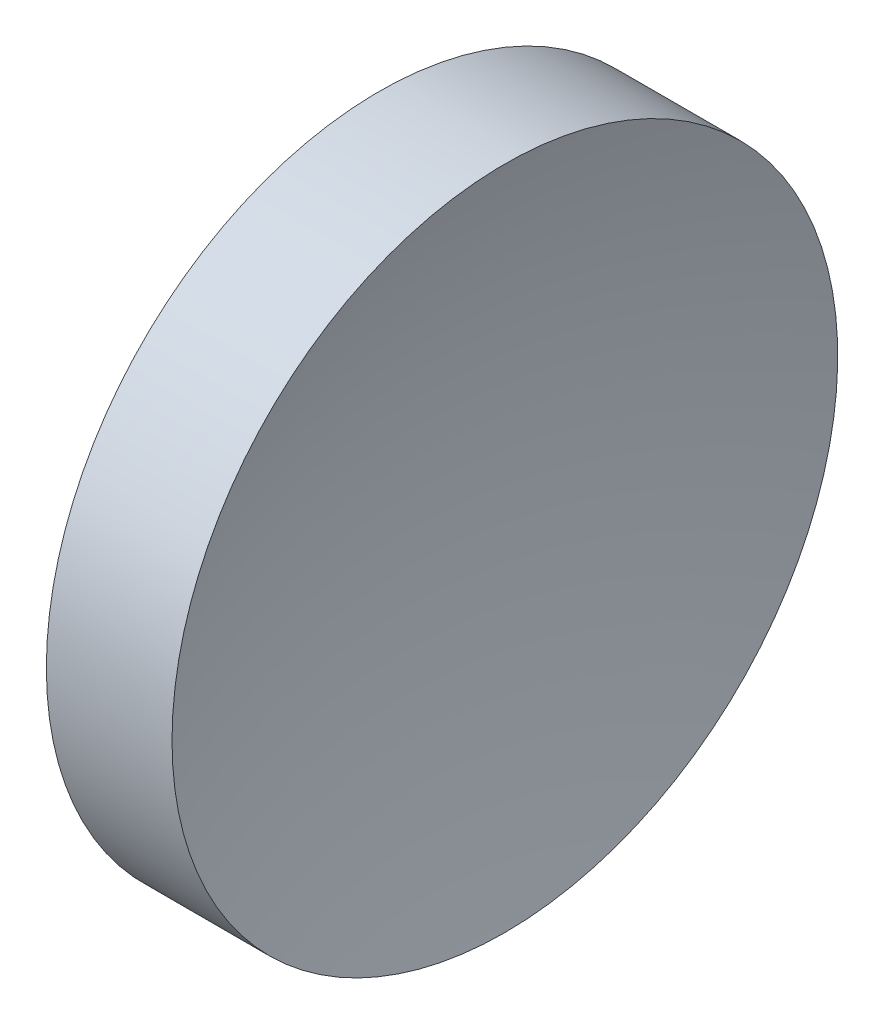
ISO-10303-21;
HEADER;
FILE_DESCRIPTION(('STEP AP214'),'2;1');
FILE_NAME('part.step','',(''),(''),'','','');
FILE_SCHEMA(('AUTOMOTIVE_DESIGN { 1 0 10303 214 1 1 1 1 }'));
ENDSEC;
DATA;
#1=APPLICATION_CONTEXT('core data for automotive mechanical design processes');
#2=APPLICATION_PROTOCOL_DEFINITION('international standard','automotive_design',2000,#1);
#3=PRODUCT_CONTEXT('',#1,'mechanical');
#4=PRODUCT('Part','Part','',(#3));
#5=PRODUCT_RELATED_PRODUCT_CATEGORY('part','',(#4));
#6=PRODUCT_DEFINITION_FORMATION('','',#4);
#7=PRODUCT_DEFINITION_CONTEXT('part definition',#1,'design');
#8=PRODUCT_DEFINITION('design','',#6,#7);
#9=PRODUCT_DEFINITION_SHAPE('','',#8);
#10=(LENGTH_UNIT() NAMED_UNIT(*) SI_UNIT(.MILLI.,.METRE.));
#11=(NAMED_UNIT(*) PLANE_ANGLE_UNIT() SI_UNIT($,.RADIAN.));
#12=(NAMED_UNIT(*) SI_UNIT($,.STERADIAN.) SOLID_ANGLE_UNIT());
#13=UNCERTAINTY_MEASURE_WITH_UNIT(LENGTH_MEASURE(1.E-05),#10,'distance_accuracy_value','');
#14=(GEOMETRIC_REPRESENTATION_CONTEXT(3) GLOBAL_UNCERTAINTY_ASSIGNED_CONTEXT((#13)) GLOBAL_UNIT_ASSIGNED_CONTEXT((#10,
#11,#12)) REPRESENTATION_CONTEXT('',''));
#15=CARTESIAN_POINT('',(0.,0.,0.));
#16=DIRECTION('',(0.,0.,1.));
#17=DIRECTION('',(1.,0.,0.));
#18=AXIS2_PLACEMENT_3D('',#15,#16,#17);
#19=CARTESIAN_POINT('',(72.1737085014825,28.4775956346375,0.));
#20=DIRECTION('',(-1.,0.,0.));
#21=DIRECTION('',(0.,-1.,0.));
#22=AXIS2_PLACEMENT_3D('',#19,#20,#21);
#23=SPHERICAL_SURFACE('',#22,22.92);
#24=CARTESIAN_POINT('',(50.1509044111764,28.4775956346375,0.));
#25=DIRECTION('',(-1.,0.,0.));
#26=DIRECTION('',(0.,0.,1.));
#27=AXIS2_PLACEMENT_3D('',#24,#25,#26);
#28=CIRCLE('',#27,6.35000000000001);
#29=CARTESIAN_POINT('',(50.1509044111764,28.4775956346375,6.35000000000001));
#30=VERTEX_POINT('',#29);
#31=EDGE_CURVE('E10',#30,#30,#28,.T.);
#32=ORIENTED_EDGE('',*,*,#31,.F.);
#33=EDGE_LOOP('',(#32));
#34=FACE_BOUND('',#33,.T.);
#35=ADVANCED_FACE('F35',(#34),#23,.F.);
#36=CARTESIAN_POINT('',(44.7820919030242,28.4775956346375,0.));
#37=DIRECTION('',(-1.,0.,0.));
#38=DIRECTION('',(0.,0.,1.));
#39=AXIS2_PLACEMENT_3D('',#36,#37,#38);
#40=CYLINDRICAL_SURFACE('',#39,6.35);
#41=CARTESIAN_POINT('',(47.7537085014825,28.4775956346375,0.));
#42=DIRECTION('',(-1.,0.,0.));
#43=DIRECTION('',(0.,0.,1.));
#44=AXIS2_PLACEMENT_3D('',#41,#42,#43);
#45=CIRCLE('',#44,6.35);
#46=CARTESIAN_POINT('',(47.7537085014825,28.4775956346375,6.35));
#47=VERTEX_POINT('',#46);
#48=EDGE_CURVE('E41',#47,#47,#45,.T.);
#49=ORIENTED_EDGE('',*,*,#48,.F.);
#50=EDGE_LOOP('',(#49));
#51=FACE_BOUND('',#50,.T.);
#52=ORIENTED_EDGE('',*,*,#31,.T.);
#53=EDGE_LOOP('',(#52));
#54=FACE_BOUND('',#53,.T.);
#55=ADVANCED_FACE('F49',(#51,#54),#40,.T.);
#56=CARTESIAN_POINT('',(47.7537085014825,28.4775956346375,0.));
#57=DIRECTION('',(1.,0.,0.));
#58=DIRECTION('',(0.,0.,-1.));
#59=AXIS2_PLACEMENT_3D('',#56,#57,#58);
#60=PLANE('',#59);
#61=ORIENTED_EDGE('',*,*,#48,.T.);
#62=EDGE_LOOP('',(#61));
#63=FACE_BOUND('',#62,.T.);
#64=ADVANCED_FACE('F47',(#63),#60,.F.);
#65=CLOSED_SHELL('',(#35,#55,#64));
#66=MANIFOLD_SOLID_BREP('B2',#65);
#67=ADVANCED_BREP_SHAPE_REPRESENTATION('',(#18,#66),#14);
#68=SHAPE_DEFINITION_REPRESENTATION(#9,#67);
ENDSEC;
END-ISO-10303-21;
